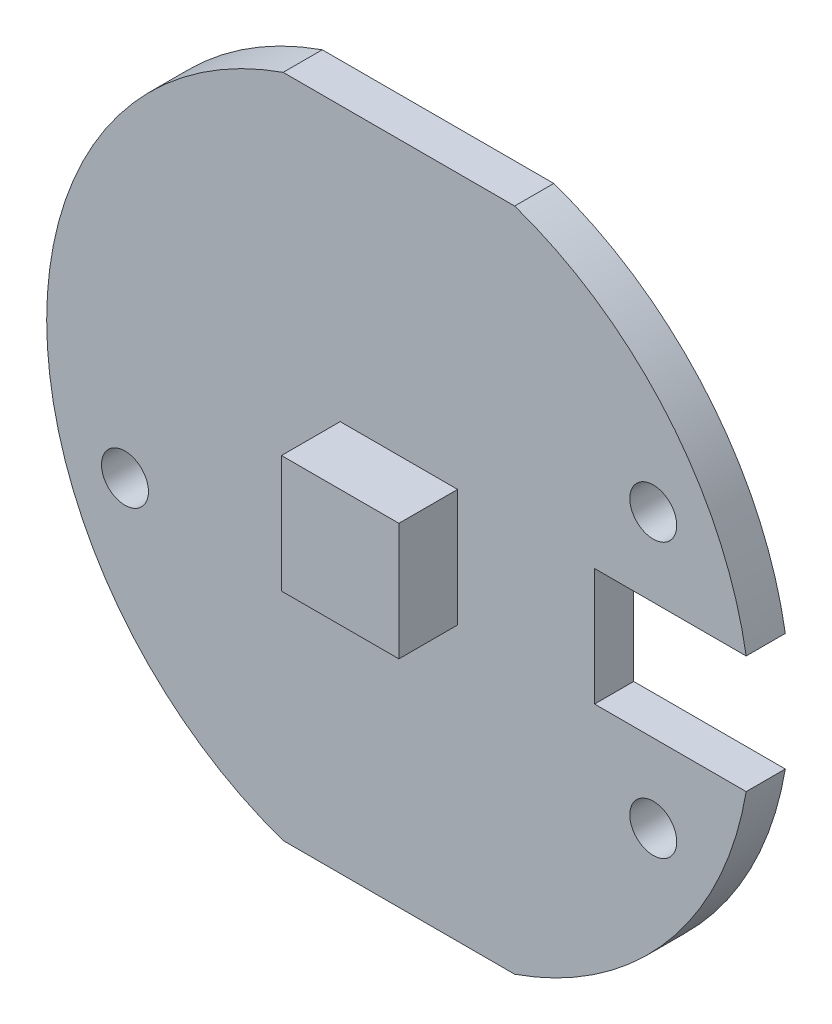
ISO-10303-21;
HEADER;
FILE_DESCRIPTION(('STEP AP214'),'2;1');
FILE_NAME('part.step','',(''),(''),'','','');
FILE_SCHEMA(('AUTOMOTIVE_DESIGN { 1 0 10303 214 1 1 1 1 }'));
ENDSEC;
DATA;
#1=APPLICATION_CONTEXT('core data for automotive mechanical design processes');
#2=APPLICATION_PROTOCOL_DEFINITION('international standard','automotive_design',2000,#1);
#3=PRODUCT_CONTEXT('',#1,'mechanical');
#4=PRODUCT('Part','Part','',(#3));
#5=PRODUCT_RELATED_PRODUCT_CATEGORY('part','',(#4));
#6=PRODUCT_DEFINITION_FORMATION('','',#4);
#7=PRODUCT_DEFINITION_CONTEXT('part definition',#1,'design');
#8=PRODUCT_DEFINITION('design','',#6,#7);
#9=PRODUCT_DEFINITION_SHAPE('','',#8);
#10=(LENGTH_UNIT() NAMED_UNIT(*) SI_UNIT(.MILLI.,.METRE.));
#11=(NAMED_UNIT(*) PLANE_ANGLE_UNIT() SI_UNIT($,.RADIAN.));
#12=(NAMED_UNIT(*) SI_UNIT($,.STERADIAN.) SOLID_ANGLE_UNIT());
#13=UNCERTAINTY_MEASURE_WITH_UNIT(LENGTH_MEASURE(1.E-05),#10,'distance_accuracy_value','');
#14=(GEOMETRIC_REPRESENTATION_CONTEXT(3) GLOBAL_UNCERTAINTY_ASSIGNED_CONTEXT((#13)) GLOBAL_UNIT_ASSIGNED_CONTEXT((#10,
#11,#12)) REPRESENTATION_CONTEXT('',''));
#15=CARTESIAN_POINT('',(0.,0.,0.));
#16=DIRECTION('',(0.,0.,1.));
#17=DIRECTION('',(1.,0.,0.));
#18=AXIS2_PLACEMENT_3D('',#15,#16,#17);
#19=CARTESIAN_POINT('',(0.,1.5,-1.));
#20=DIRECTION('',(0.,-1.,0.));
#21=DIRECTION('',(0.,0.,-1.));
#22=AXIS2_PLACEMENT_3D('',#19,#20,#21);
#23=PLANE('',#22);
#24=DIRECTION('',(1.,0.,0.));
#25=VECTOR('',#24,1.);
#26=CARTESIAN_POINT('',(0.,1.5,0.));
#27=LINE('',#26,#25);
#28=CARTESIAN_POINT('',(5.,1.5,0.));
#29=VERTEX_POINT('',#28);
#30=CARTESIAN_POINT('',(8.87411967464942,1.5,0.));
#31=VERTEX_POINT('',#30);
#32=EDGE_CURVE('E240',#29,#31,#27,.T.);
#33=ORIENTED_EDGE('',*,*,#32,.F.);
#34=DIRECTION('',(0.,0.,1.));
#35=VECTOR('',#34,1.);
#36=CARTESIAN_POINT('',(5.,1.5,-1.));
#37=LINE('',#36,#35);
#38=CARTESIAN_POINT('',(5.,1.5,-1.));
#39=VERTEX_POINT('',#38);
#40=EDGE_CURVE('E11',#39,#29,#37,.T.);
#41=ORIENTED_EDGE('',*,*,#40,.F.);
#42=DIRECTION('',(1.,0.,0.));
#43=VECTOR('',#42,1.);
#44=CARTESIAN_POINT('',(0.,1.5,-1.));
#45=LINE('',#44,#43);
#46=CARTESIAN_POINT('',(8.87411967464942,1.5,-1.));
#47=VERTEX_POINT('',#46);
#48=EDGE_CURVE('E149',#39,#47,#45,.T.);
#49=ORIENTED_EDGE('',*,*,#48,.T.);
#50=DIRECTION('',(0.,0.,1.));
#51=VECTOR('',#50,1.);
#52=CARTESIAN_POINT('',(8.87411967464942,1.5,-1.));
#53=LINE('',#52,#51);
#54=EDGE_CURVE('E39',#47,#31,#53,.T.);
#55=ORIENTED_EDGE('',*,*,#54,.T.);
#56=EDGE_LOOP('',(#33,#41,#49,#55));
#57=FACE_BOUND('',#56,.T.);
#58=ADVANCED_FACE('F35',(#57),#23,.T.);
#59=CARTESIAN_POINT('',(5.,0.,-1.));
#60=DIRECTION('',(-1.,0.,0.));
#61=DIRECTION('',(0.,0.,1.));
#62=AXIS2_PLACEMENT_3D('',#59,#60,#61);
#63=PLANE('',#62);
#64=DIRECTION('',(0.,-1.,0.));
#65=VECTOR('',#64,1.);
#66=CARTESIAN_POINT('',(5.,0.,0.));
#67=LINE('',#66,#65);
#68=CARTESIAN_POINT('',(5.,-1.5,0.));
#69=VERTEX_POINT('',#68);
#70=EDGE_CURVE('E160',#29,#69,#67,.T.);
#71=ORIENTED_EDGE('',*,*,#70,.T.);
#72=DIRECTION('',(0.,0.,1.));
#73=VECTOR('',#72,1.);
#74=CARTESIAN_POINT('',(5.,-1.5,-1.));
#75=LINE('',#74,#73);
#76=CARTESIAN_POINT('',(5.,-1.5,-1.));
#77=VERTEX_POINT('',#76);
#78=EDGE_CURVE('E44',#77,#69,#75,.T.);
#79=ORIENTED_EDGE('',*,*,#78,.F.);
#80=DIRECTION('',(0.,-1.,0.));
#81=VECTOR('',#80,1.);
#82=CARTESIAN_POINT('',(5.,0.,-1.));
#83=LINE('',#82,#81);
#84=EDGE_CURVE('E125',#39,#77,#83,.T.);
#85=ORIENTED_EDGE('',*,*,#84,.F.);
#86=ORIENTED_EDGE('',*,*,#40,.T.);
#87=EDGE_LOOP('',(#71,#79,#85,#86));
#88=FACE_BOUND('',#87,.T.);
#89=ADVANCED_FACE('F283',(#88),#63,.F.);
#90=CARTESIAN_POINT('',(0.,-1.5,-1.));
#91=DIRECTION('',(0.,-1.,0.));
#92=DIRECTION('',(0.,0.,-1.));
#93=AXIS2_PLACEMENT_3D('',#90,#91,#92);
#94=PLANE('',#93);
#95=DIRECTION('',(1.,0.,0.));
#96=VECTOR('',#95,1.);
#97=CARTESIAN_POINT('',(0.,-1.5,0.));
#98=LINE('',#97,#96);
#99=CARTESIAN_POINT('',(8.87411967464942,-1.5,0.));
#100=VERTEX_POINT('',#99);
#101=EDGE_CURVE('E133',#69,#100,#98,.T.);
#102=ORIENTED_EDGE('',*,*,#101,.T.);
#103=DIRECTION('',(0.,0.,1.));
#104=VECTOR('',#103,1.);
#105=CARTESIAN_POINT('',(8.87411967464942,-1.5,-1.));
#106=LINE('',#105,#104);
#107=CARTESIAN_POINT('',(8.87411967464942,-1.5,-1.));
#108=VERTEX_POINT('',#107);
#109=EDGE_CURVE('E131',#108,#100,#106,.T.);
#110=ORIENTED_EDGE('',*,*,#109,.F.);
#111=DIRECTION('',(1.,0.,0.));
#112=VECTOR('',#111,1.);
#113=CARTESIAN_POINT('',(0.,-1.5,-1.));
#114=LINE('',#113,#112);
#115=EDGE_CURVE('E117',#77,#108,#114,.T.);
#116=ORIENTED_EDGE('',*,*,#115,.F.);
#117=ORIENTED_EDGE('',*,*,#78,.T.);
#118=EDGE_LOOP('',(#102,#110,#116,#117));
#119=FACE_BOUND('',#118,.T.);
#120=ADVANCED_FACE('F132',(#119),#94,.F.);
#121=CARTESIAN_POINT('',(0.,0.,-1.));
#122=DIRECTION('',(0.,0.,1.));
#123=DIRECTION('',(1.,0.,0.));
#124=AXIS2_PLACEMENT_3D('',#121,#122,#123);
#125=CYLINDRICAL_SURFACE('',#124,9.);
#126=CARTESIAN_POINT('',(0.,0.,0.));
#127=DIRECTION('',(0.,0.,1.));
#128=DIRECTION('',(1.,0.,0.));
#129=AXIS2_PLACEMENT_3D('',#126,#127,#128);
#130=CIRCLE('',#129,9.);
#131=CARTESIAN_POINT('',(2.9580398915498,-8.5,0.));
#132=VERTEX_POINT('',#131);
#133=EDGE_CURVE('E246',#132,#100,#130,.T.);
#134=ORIENTED_EDGE('',*,*,#133,.F.);
#135=DIRECTION('',(0.,0.,1.));
#136=VECTOR('',#135,1.);
#137=CARTESIAN_POINT('',(2.9580398915498,-8.5,-1.));
#138=LINE('',#137,#136);
#139=CARTESIAN_POINT('',(2.9580398915498,-8.5,-1.));
#140=VERTEX_POINT('',#139);
#141=EDGE_CURVE('E137',#140,#132,#138,.T.);
#142=ORIENTED_EDGE('',*,*,#141,.F.);
#143=CARTESIAN_POINT('',(0.,0.,-1.));
#144=DIRECTION('',(0.,0.,1.));
#145=DIRECTION('',(1.,0.,0.));
#146=AXIS2_PLACEMENT_3D('',#143,#144,#145);
#147=CIRCLE('',#146,9.);
#148=EDGE_CURVE('E123',#140,#108,#147,.T.);
#149=ORIENTED_EDGE('',*,*,#148,.T.);
#150=ORIENTED_EDGE('',*,*,#109,.T.);
#151=EDGE_LOOP('',(#134,#142,#149,#150));
#152=FACE_BOUND('',#151,.T.);
#153=ADVANCED_FACE('F139',(#152),#125,.T.);
#154=CARTESIAN_POINT('',(0.,-8.5,-1.));
#155=DIRECTION('',(0.,-1.,0.));
#156=DIRECTION('',(0.,0.,-1.));
#157=AXIS2_PLACEMENT_3D('',#154,#155,#156);
#158=PLANE('',#157);
#159=DIRECTION('',(1.,0.,0.));
#160=VECTOR('',#159,1.);
#161=CARTESIAN_POINT('',(0.,-8.5,0.));
#162=LINE('',#161,#160);
#163=CARTESIAN_POINT('',(-2.9580398915498,-8.5,0.));
#164=VERTEX_POINT('',#163);
#165=EDGE_CURVE('E253',#164,#132,#162,.T.);
#166=ORIENTED_EDGE('',*,*,#165,.F.);
#167=DIRECTION('',(0.,0.,1.));
#168=VECTOR('',#167,1.);
#169=CARTESIAN_POINT('',(-2.9580398915498,-8.5,-1.));
#170=LINE('',#169,#168);
#171=CARTESIAN_POINT('',(-2.9580398915498,-8.5,-1.));
#172=VERTEX_POINT('',#171);
#173=EDGE_CURVE('E260',#172,#164,#170,.T.);
#174=ORIENTED_EDGE('',*,*,#173,.F.);
#175=DIRECTION('',(1.,0.,0.));
#176=VECTOR('',#175,1.);
#177=CARTESIAN_POINT('',(0.,-8.5,-1.));
#178=LINE('',#177,#176);
#179=EDGE_CURVE('E140',#172,#140,#178,.T.);
#180=ORIENTED_EDGE('',*,*,#179,.T.);
#181=ORIENTED_EDGE('',*,*,#141,.T.);
#182=EDGE_LOOP('',(#166,#174,#180,#181));
#183=FACE_BOUND('',#182,.T.);
#184=ADVANCED_FACE('F294',(#183),#158,.T.);
#185=CARTESIAN_POINT('',(-2.9580398915498,8.5,0.));
#186=VERTEX_POINT('',#185);
#187=EDGE_CURVE('E247',#186,#164,#130,.T.);
#188=ORIENTED_EDGE('',*,*,#187,.F.);
#189=DIRECTION('',(0.,0.,1.));
#190=VECTOR('',#189,1.);
#191=CARTESIAN_POINT('',(-2.9580398915498,8.5,-1.));
#192=LINE('',#191,#190);
#193=CARTESIAN_POINT('',(-2.9580398915498,8.5,-1.));
#194=VERTEX_POINT('',#193);
#195=EDGE_CURVE('E262',#194,#186,#192,.T.);
#196=ORIENTED_EDGE('',*,*,#195,.F.);
#197=EDGE_CURVE('E142',#194,#172,#147,.T.);
#198=ORIENTED_EDGE('',*,*,#197,.T.);
#199=ORIENTED_EDGE('',*,*,#173,.T.);
#200=EDGE_LOOP('',(#188,#196,#198,#199));
#201=FACE_BOUND('',#200,.T.);
#202=ADVANCED_FACE('F292',(#201),#125,.T.);
#203=CARTESIAN_POINT('',(0.,8.5,-1.));
#204=DIRECTION('',(0.,-1.,0.));
#205=DIRECTION('',(0.,0.,-1.));
#206=AXIS2_PLACEMENT_3D('',#203,#204,#205);
#207=PLANE('',#206);
#208=DIRECTION('',(1.,0.,0.));
#209=VECTOR('',#208,1.);
#210=CARTESIAN_POINT('',(0.,8.5,0.));
#211=LINE('',#210,#209);
#212=CARTESIAN_POINT('',(2.9580398915498,8.5,0.));
#213=VERTEX_POINT('',#212);
#214=EDGE_CURVE('E244',#186,#213,#211,.T.);
#215=ORIENTED_EDGE('',*,*,#214,.T.);
#216=DIRECTION('',(0.,0.,1.));
#217=VECTOR('',#216,1.);
#218=CARTESIAN_POINT('',(2.9580398915498,8.5,-1.));
#219=LINE('',#218,#217);
#220=CARTESIAN_POINT('',(2.9580398915498,8.5,-1.));
#221=VERTEX_POINT('',#220);
#222=EDGE_CURVE('E263',#221,#213,#219,.T.);
#223=ORIENTED_EDGE('',*,*,#222,.F.);
#224=DIRECTION('',(1.,0.,0.));
#225=VECTOR('',#224,1.);
#226=CARTESIAN_POINT('',(0.,8.5,-1.));
#227=LINE('',#226,#225);
#228=EDGE_CURVE('E148',#194,#221,#227,.T.);
#229=ORIENTED_EDGE('',*,*,#228,.F.);
#230=ORIENTED_EDGE('',*,*,#195,.T.);
#231=EDGE_LOOP('',(#215,#223,#229,#230));
#232=FACE_BOUND('',#231,.T.);
#233=ADVANCED_FACE('F278',(#232),#207,.F.);
#234=CARTESIAN_POINT('',(-7.,-2.5,-1.));
#235=DIRECTION('',(0.,0.,1.));
#236=DIRECTION('',(1.,0.,0.));
#237=AXIS2_PLACEMENT_3D('',#234,#235,#236);
#238=CYLINDRICAL_SURFACE('',#237,0.6);
#239=CARTESIAN_POINT('',(-7.,-2.5,-1.));
#240=DIRECTION('',(0.,0.,1.));
#241=DIRECTION('',(1.,0.,0.));
#242=AXIS2_PLACEMENT_3D('',#239,#240,#241);
#243=CIRCLE('',#242,0.6);
#244=CARTESIAN_POINT('',(-6.4,-2.5,-1.));
#245=VERTEX_POINT('',#244);
#246=EDGE_CURVE('E150',#245,#245,#243,.T.);
#247=ORIENTED_EDGE('',*,*,#246,.F.);
#248=EDGE_LOOP('',(#247));
#249=FACE_BOUND('',#248,.T.);
#250=CARTESIAN_POINT('',(-7.,-2.5,0.));
#251=DIRECTION('',(0.,0.,1.));
#252=DIRECTION('',(1.,0.,0.));
#253=AXIS2_PLACEMENT_3D('',#250,#251,#252);
#254=CIRCLE('',#253,0.6);
#255=CARTESIAN_POINT('',(-6.4,-2.5,0.));
#256=VERTEX_POINT('',#255);
#257=EDGE_CURVE('E237',#256,#256,#254,.T.);
#258=ORIENTED_EDGE('',*,*,#257,.T.);
#259=EDGE_LOOP('',(#258));
#260=FACE_BOUND('',#259,.T.);
#261=ADVANCED_FACE('F270',(#249,#260),#238,.F.);
#262=CARTESIAN_POINT('',(6.5,-3.5,-1.));
#263=DIRECTION('',(0.,0.,1.));
#264=DIRECTION('',(1.,0.,0.));
#265=AXIS2_PLACEMENT_3D('',#262,#263,#264);
#266=CYLINDRICAL_SURFACE('',#265,0.6);
#267=CARTESIAN_POINT('',(6.5,-3.5,-1.));
#268=DIRECTION('',(0.,0.,1.));
#269=DIRECTION('',(1.,0.,0.));
#270=AXIS2_PLACEMENT_3D('',#267,#268,#269);
#271=CIRCLE('',#270,0.6);
#272=CARTESIAN_POINT('',(7.1,-3.5,-1.));
#273=VERTEX_POINT('',#272);
#274=EDGE_CURVE('E152',#273,#273,#271,.T.);
#275=ORIENTED_EDGE('',*,*,#274,.F.);
#276=EDGE_LOOP('',(#275));
#277=FACE_BOUND('',#276,.T.);
#278=CARTESIAN_POINT('',(6.5,-3.5,0.));
#279=DIRECTION('',(0.,0.,1.));
#280=DIRECTION('',(1.,0.,0.));
#281=AXIS2_PLACEMENT_3D('',#278,#279,#280);
#282=CIRCLE('',#281,0.6);
#283=CARTESIAN_POINT('',(7.1,-3.5,0.));
#284=VERTEX_POINT('',#283);
#285=EDGE_CURVE('E233',#284,#284,#282,.T.);
#286=ORIENTED_EDGE('',*,*,#285,.T.);
#287=EDGE_LOOP('',(#286));
#288=FACE_BOUND('',#287,.T.);
#289=ADVANCED_FACE('F268',(#277,#288),#266,.F.);
#290=CARTESIAN_POINT('',(6.5,3.5,-1.));
#291=DIRECTION('',(0.,0.,1.));
#292=DIRECTION('',(1.,0.,0.));
#293=AXIS2_PLACEMENT_3D('',#290,#291,#292);
#294=CYLINDRICAL_SURFACE('',#293,0.6);
#295=CARTESIAN_POINT('',(6.5,3.5,-1.));
#296=DIRECTION('',(0.,0.,1.));
#297=DIRECTION('',(1.,0.,0.));
#298=AXIS2_PLACEMENT_3D('',#295,#296,#297);
#299=CIRCLE('',#298,0.6);
#300=CARTESIAN_POINT('',(7.1,3.5,-1.));
#301=VERTEX_POINT('',#300);
#302=EDGE_CURVE('E157',#301,#301,#299,.T.);
#303=ORIENTED_EDGE('',*,*,#302,.F.);
#304=EDGE_LOOP('',(#303));
#305=FACE_BOUND('',#304,.T.);
#306=CARTESIAN_POINT('',(6.5,3.5,0.));
#307=DIRECTION('',(0.,0.,1.));
#308=DIRECTION('',(1.,0.,0.));
#309=AXIS2_PLACEMENT_3D('',#306,#307,#308);
#310=CIRCLE('',#309,0.6);
#311=CARTESIAN_POINT('',(7.1,3.5,0.));
#312=VERTEX_POINT('',#311);
#313=EDGE_CURVE('E164',#312,#312,#310,.T.);
#314=ORIENTED_EDGE('',*,*,#313,.T.);
#315=EDGE_LOOP('',(#314));
#316=FACE_BOUND('',#315,.T.);
#317=ADVANCED_FACE('F37',(#305,#316),#294,.F.);
#318=EDGE_CURVE('E242',#31,#213,#130,.T.);
#319=ORIENTED_EDGE('',*,*,#318,.F.);
#320=ORIENTED_EDGE('',*,*,#54,.F.);
#321=EDGE_CURVE('E143',#47,#221,#147,.T.);
#322=ORIENTED_EDGE('',*,*,#321,.T.);
#323=ORIENTED_EDGE('',*,*,#222,.T.);
#324=EDGE_LOOP('',(#319,#320,#322,#323));
#325=FACE_BOUND('',#324,.T.);
#326=ADVANCED_FACE('F276',(#325),#125,.T.);
#327=CARTESIAN_POINT('',(0.,0.,-1.));
#328=DIRECTION('',(0.,0.,1.));
#329=DIRECTION('',(1.,0.,0.));
#330=AXIS2_PLACEMENT_3D('',#327,#328,#329);
#331=PLANE('',#330);
#332=ORIENTED_EDGE('',*,*,#302,.T.);
#333=EDGE_LOOP('',(#332));
#334=FACE_BOUND('',#333,.T.);
#335=ORIENTED_EDGE('',*,*,#274,.T.);
#336=EDGE_LOOP('',(#335));
#337=FACE_BOUND('',#336,.T.);
#338=ORIENTED_EDGE('',*,*,#246,.T.);
#339=EDGE_LOOP('',(#338));
#340=FACE_BOUND('',#339,.T.);
#341=ORIENTED_EDGE('',*,*,#48,.F.);
#342=ORIENTED_EDGE('',*,*,#84,.T.);
#343=ORIENTED_EDGE('',*,*,#115,.T.);
#344=ORIENTED_EDGE('',*,*,#148,.F.);
#345=ORIENTED_EDGE('',*,*,#179,.F.);
#346=ORIENTED_EDGE('',*,*,#197,.F.);
#347=ORIENTED_EDGE('',*,*,#228,.T.);
#348=ORIENTED_EDGE('',*,*,#321,.F.);
#349=EDGE_LOOP('',(#341,#342,#343,#344,#345,#346,#347,#348));
#350=FACE_BOUND('',#349,.T.);
#351=ADVANCED_FACE('F120',(#334,#337,#340,#350),#331,.F.);
#352=CARTESIAN_POINT('',(0.,0.,0.));
#353=DIRECTION('',(0.,0.,1.));
#354=DIRECTION('',(1.,0.,0.));
#355=AXIS2_PLACEMENT_3D('',#352,#353,#354);
#356=PLANE('',#355);
#357=DIRECTION('',(0.,-1.,0.));
#358=VECTOR('',#357,1.);
#359=CARTESIAN_POINT('',(1.5,0.,0.));
#360=LINE('',#359,#358);
#361=CARTESIAN_POINT('',(1.5,1.5,0.));
#362=VERTEX_POINT('',#361);
#363=CARTESIAN_POINT('',(1.5,-1.5,0.));
#364=VERTEX_POINT('',#363);
#365=EDGE_CURVE('E181',#362,#364,#360,.T.);
#366=ORIENTED_EDGE('',*,*,#365,.T.);
#367=DIRECTION('',(1.,0.,0.));
#368=VECTOR('',#367,1.);
#369=CARTESIAN_POINT('',(0.,-1.5,0.));
#370=LINE('',#369,#368);
#371=CARTESIAN_POINT('',(-1.5,-1.5,0.));
#372=VERTEX_POINT('',#371);
#373=EDGE_CURVE('E173',#372,#364,#370,.T.);
#374=ORIENTED_EDGE('',*,*,#373,.F.);
#375=DIRECTION('',(0.,-1.,0.));
#376=VECTOR('',#375,1.);
#377=CARTESIAN_POINT('',(-1.5,0.,0.));
#378=LINE('',#377,#376);
#379=CARTESIAN_POINT('',(-1.5,1.5,0.));
#380=VERTEX_POINT('',#379);
#381=EDGE_CURVE('E176',#380,#372,#378,.T.);
#382=ORIENTED_EDGE('',*,*,#381,.F.);
#383=DIRECTION('',(1.,0.,0.));
#384=VECTOR('',#383,1.);
#385=CARTESIAN_POINT('',(0.,1.5,0.));
#386=LINE('',#385,#384);
#387=EDGE_CURVE('E178',#380,#362,#386,.T.);
#388=ORIENTED_EDGE('',*,*,#387,.T.);
#389=EDGE_LOOP('',(#366,#374,#382,#388));
#390=FACE_BOUND('',#389,.T.);
#391=ORIENTED_EDGE('',*,*,#313,.F.);
#392=EDGE_LOOP('',(#391));
#393=FACE_BOUND('',#392,.T.);
#394=ORIENTED_EDGE('',*,*,#285,.F.);
#395=EDGE_LOOP('',(#394));
#396=FACE_BOUND('',#395,.T.);
#397=ORIENTED_EDGE('',*,*,#257,.F.);
#398=EDGE_LOOP('',(#397));
#399=FACE_BOUND('',#398,.T.);
#400=ORIENTED_EDGE('',*,*,#32,.T.);
#401=ORIENTED_EDGE('',*,*,#318,.T.);
#402=ORIENTED_EDGE('',*,*,#214,.F.);
#403=ORIENTED_EDGE('',*,*,#187,.T.);
#404=ORIENTED_EDGE('',*,*,#165,.T.);
#405=ORIENTED_EDGE('',*,*,#133,.T.);
#406=ORIENTED_EDGE('',*,*,#101,.F.);
#407=ORIENTED_EDGE('',*,*,#70,.F.);
#408=EDGE_LOOP('',(#400,#401,#402,#403,#404,#405,#406,#407));
#409=FACE_BOUND('',#408,.T.);
#410=ADVANCED_FACE('F223',(#390,#393,#396,#399,#409),#356,.T.);
#411=CARTESIAN_POINT('',(1.5,0.,1.5));
#412=DIRECTION('',(1.,0.,0.));
#413=DIRECTION('',(0.,1.,0.));
#414=AXIS2_PLACEMENT_3D('',#411,#412,#413);
#415=PLANE('',#414);
#416=ORIENTED_EDGE('',*,*,#365,.F.);
#417=DIRECTION('',(0.,0.,-1.));
#418=VECTOR('',#417,1.);
#419=CARTESIAN_POINT('',(1.5,1.5,1.5));
#420=LINE('',#419,#418);
#421=CARTESIAN_POINT('',(1.5,1.5,1.5));
#422=VERTEX_POINT('',#421);
#423=EDGE_CURVE('E161',#422,#362,#420,.T.);
#424=ORIENTED_EDGE('',*,*,#423,.F.);
#425=DIRECTION('',(0.,-1.,0.));
#426=VECTOR('',#425,1.);
#427=CARTESIAN_POINT('',(1.5,0.,1.5));
#428=LINE('',#427,#426);
#429=CARTESIAN_POINT('',(1.5,-1.5,1.5));
#430=VERTEX_POINT('',#429);
#431=EDGE_CURVE('E175',#422,#430,#428,.T.);
#432=ORIENTED_EDGE('',*,*,#431,.T.);
#433=DIRECTION('',(0.,0.,-1.));
#434=VECTOR('',#433,1.);
#435=CARTESIAN_POINT('',(1.5,-1.5,1.5));
#436=LINE('',#435,#434);
#437=EDGE_CURVE('E169',#430,#364,#436,.T.);
#438=ORIENTED_EDGE('',*,*,#437,.T.);
#439=EDGE_LOOP('',(#416,#424,#432,#438));
#440=FACE_BOUND('',#439,.T.);
#441=ADVANCED_FACE('F197',(#440),#415,.T.);
#442=CARTESIAN_POINT('',(0.,1.5,1.5));
#443=DIRECTION('',(0.,1.,0.));
#444=DIRECTION('',(-1.,0.,0.));
#445=AXIS2_PLACEMENT_3D('',#442,#443,#444);
#446=PLANE('',#445);
#447=ORIENTED_EDGE('',*,*,#387,.F.);
#448=DIRECTION('',(0.,0.,-1.));
#449=VECTOR('',#448,1.);
#450=CARTESIAN_POINT('',(-1.5,1.5,1.5));
#451=LINE('',#450,#449);
#452=CARTESIAN_POINT('',(-1.5,1.5,1.5));
#453=VERTEX_POINT('',#452);
#454=EDGE_CURVE('E165',#453,#380,#451,.T.);
#455=ORIENTED_EDGE('',*,*,#454,.F.);
#456=DIRECTION('',(1.,0.,0.));
#457=VECTOR('',#456,1.);
#458=CARTESIAN_POINT('',(0.,1.5,1.5));
#459=LINE('',#458,#457);
#460=EDGE_CURVE('E189',#453,#422,#459,.T.);
#461=ORIENTED_EDGE('',*,*,#460,.T.);
#462=ORIENTED_EDGE('',*,*,#423,.T.);
#463=EDGE_LOOP('',(#447,#455,#461,#462));
#464=FACE_BOUND('',#463,.T.);
#465=ADVANCED_FACE('F210',(#464),#446,.T.);
#466=CARTESIAN_POINT('',(-1.5,0.,1.5));
#467=DIRECTION('',(1.,0.,0.));
#468=DIRECTION('',(0.,1.,0.));
#469=AXIS2_PLACEMENT_3D('',#466,#467,#468);
#470=PLANE('',#469);
#471=ORIENTED_EDGE('',*,*,#381,.T.);
#472=DIRECTION('',(0.,0.,-1.));
#473=VECTOR('',#472,1.);
#474=CARTESIAN_POINT('',(-1.5,-1.5,1.5));
#475=LINE('',#474,#473);
#476=CARTESIAN_POINT('',(-1.5,-1.5,1.5));
#477=VERTEX_POINT('',#476);
#478=EDGE_CURVE('E52',#477,#372,#475,.T.);
#479=ORIENTED_EDGE('',*,*,#478,.F.);
#480=DIRECTION('',(0.,-1.,0.));
#481=VECTOR('',#480,1.);
#482=CARTESIAN_POINT('',(-1.5,0.,1.5));
#483=LINE('',#482,#481);
#484=EDGE_CURVE('E186',#453,#477,#483,.T.);
#485=ORIENTED_EDGE('',*,*,#484,.F.);
#486=ORIENTED_EDGE('',*,*,#454,.T.);
#487=EDGE_LOOP('',(#471,#479,#485,#486));
#488=FACE_BOUND('',#487,.T.);
#489=ADVANCED_FACE('F217',(#488),#470,.F.);
#490=CARTESIAN_POINT('',(0.,-1.5,1.5));
#491=DIRECTION('',(0.,1.,0.));
#492=DIRECTION('',(-1.,0.,0.));
#493=AXIS2_PLACEMENT_3D('',#490,#491,#492);
#494=PLANE('',#493);
#495=ORIENTED_EDGE('',*,*,#373,.T.);
#496=ORIENTED_EDGE('',*,*,#437,.F.);
#497=DIRECTION('',(1.,0.,0.));
#498=VECTOR('',#497,1.);
#499=CARTESIAN_POINT('',(0.,-1.5,1.5));
#500=LINE('',#499,#498);
#501=EDGE_CURVE('E172',#477,#430,#500,.T.);
#502=ORIENTED_EDGE('',*,*,#501,.F.);
#503=ORIENTED_EDGE('',*,*,#478,.T.);
#504=EDGE_LOOP('',(#495,#496,#502,#503));
#505=FACE_BOUND('',#504,.T.);
#506=ADVANCED_FACE('F221',(#505),#494,.F.);
#507=CARTESIAN_POINT('',(0.,0.,1.5));
#508=DIRECTION('',(0.,0.,1.));
#509=DIRECTION('',(1.,0.,0.));
#510=AXIS2_PLACEMENT_3D('',#507,#508,#509);
#511=PLANE('',#510);
#512=ORIENTED_EDGE('',*,*,#431,.F.);
#513=ORIENTED_EDGE('',*,*,#460,.F.);
#514=ORIENTED_EDGE('',*,*,#484,.T.);
#515=ORIENTED_EDGE('',*,*,#501,.T.);
#516=EDGE_LOOP('',(#512,#513,#514,#515));
#517=FACE_BOUND('',#516,.T.);
#518=ADVANCED_FACE('F204',(#517),#511,.T.);
#519=CLOSED_SHELL('',(#58,#89,#120,#153,#184,#202,#233,#261,#289,#317,#326,#351,#410,#441,#465,
#489,#506,#518));
#520=MANIFOLD_SOLID_BREP('B2',#519);
#521=ADVANCED_BREP_SHAPE_REPRESENTATION('',(#18,#520),#14);
#522=SHAPE_DEFINITION_REPRESENTATION(#9,#521);
ENDSEC;
END-ISO-10303-21;
